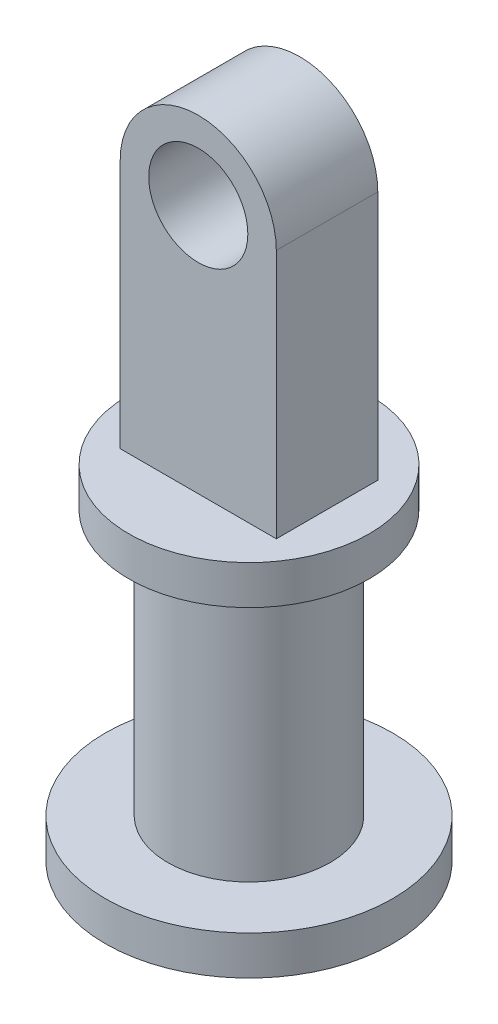
ISO-10303-21;
HEADER;
FILE_DESCRIPTION(('STEP AP214'),'2;1');
FILE_NAME('part.step','',(''),(''),'','','');
FILE_SCHEMA(('AUTOMOTIVE_DESIGN { 1 0 10303 214 1 1 1 1 }'));
ENDSEC;
DATA;
#1=APPLICATION_CONTEXT('core data for automotive mechanical design processes');
#2=APPLICATION_PROTOCOL_DEFINITION('international standard','automotive_design',2000,#1);
#3=PRODUCT_CONTEXT('',#1,'mechanical');
#4=PRODUCT('Part','Part','',(#3));
#5=PRODUCT_RELATED_PRODUCT_CATEGORY('part','',(#4));
#6=PRODUCT_DEFINITION_FORMATION('','',#4);
#7=PRODUCT_DEFINITION_CONTEXT('part definition',#1,'design');
#8=PRODUCT_DEFINITION('design','',#6,#7);
#9=PRODUCT_DEFINITION_SHAPE('','',#8);
#10=(LENGTH_UNIT() NAMED_UNIT(*) SI_UNIT(.MILLI.,.METRE.));
#11=(NAMED_UNIT(*) PLANE_ANGLE_UNIT() SI_UNIT($,.RADIAN.));
#12=(NAMED_UNIT(*) SI_UNIT($,.STERADIAN.) SOLID_ANGLE_UNIT());
#13=UNCERTAINTY_MEASURE_WITH_UNIT(LENGTH_MEASURE(1.E-05),#10,'distance_accuracy_value','');
#14=(GEOMETRIC_REPRESENTATION_CONTEXT(3) GLOBAL_UNCERTAINTY_ASSIGNED_CONTEXT((#13)) GLOBAL_UNIT_ASSIGNED_CONTEXT((#10,
#11,#12)) REPRESENTATION_CONTEXT('',''));
#15=CARTESIAN_POINT('',(0.,0.,0.));
#16=DIRECTION('',(0.,0.,1.));
#17=DIRECTION('',(1.,0.,0.));
#18=AXIS2_PLACEMENT_3D('',#15,#16,#17);
#19=CARTESIAN_POINT('',(0.,0.,3.25));
#20=DIRECTION('',(0.,0.,1.));
#21=DIRECTION('',(1.,0.,0.));
#22=AXIS2_PLACEMENT_3D('',#19,#20,#21);
#23=PLANE('',#22);
#24=CARTESIAN_POINT('',(0.,0.,3.25));
#25=DIRECTION('',(0.,0.,1.));
#26=DIRECTION('',(1.,0.,0.));
#27=AXIS2_PLACEMENT_3D('',#24,#25,#26);
#28=CIRCLE('',#27,2.5);
#29=CARTESIAN_POINT('',(2.5,0.,3.25));
#30=VERTEX_POINT('',#29);
#31=CARTESIAN_POINT('',(-2.5,0.,3.25));
#32=VERTEX_POINT('',#31);
#33=EDGE_CURVE('E79',#30,#32,#28,.T.);
#34=ORIENTED_EDGE('',*,*,#33,.T.);
#35=DIRECTION('',(0.,-1.,0.));
#36=VECTOR('',#35,1.);
#37=CARTESIAN_POINT('',(-2.5,-8.,3.25));
#38=LINE('',#37,#36);
#39=CARTESIAN_POINT('',(-2.5,-8.,3.25));
#40=VERTEX_POINT('',#39);
#41=EDGE_CURVE('E110',#32,#40,#38,.T.);
#42=ORIENTED_EDGE('',*,*,#41,.T.);
#43=DIRECTION('',(1.,0.,0.));
#44=VECTOR('',#43,1.);
#45=CARTESIAN_POINT('',(2.5,-8.,3.25));
#46=LINE('',#45,#44);
#47=CARTESIAN_POINT('',(2.5,-8.,3.25));
#48=VERTEX_POINT('',#47);
#49=EDGE_CURVE('E104',#40,#48,#46,.T.);
#50=ORIENTED_EDGE('',*,*,#49,.T.);
#51=DIRECTION('',(0.,1.,0.));
#52=VECTOR('',#51,1.);
#53=CARTESIAN_POINT('',(2.5,0.,3.25));
#54=LINE('',#53,#52);
#55=EDGE_CURVE('E51',#48,#30,#54,.T.);
#56=ORIENTED_EDGE('',*,*,#55,.T.);
#57=EDGE_LOOP('',(#34,#42,#50,#56));
#58=FACE_BOUND('',#57,.T.);
#59=CARTESIAN_POINT('',(0.,0.,3.25));
#60=DIRECTION('',(0.,0.,1.));
#61=DIRECTION('',(1.,0.,0.));
#62=AXIS2_PLACEMENT_3D('',#59,#60,#61);
#63=CIRCLE('',#62,1.5875);
#64=CARTESIAN_POINT('',(1.5875,0.,3.25));
#65=VERTEX_POINT('',#64);
#66=EDGE_CURVE('E90',#65,#65,#63,.T.);
#67=ORIENTED_EDGE('',*,*,#66,.F.);
#68=EDGE_LOOP('',(#67));
#69=FACE_BOUND('',#68,.T.);
#70=ADVANCED_FACE('F34',(#58,#69),#23,.T.);
#71=CARTESIAN_POINT('',(0.,0.,0.));
#72=DIRECTION('',(0.,0.,1.));
#73=DIRECTION('',(1.,0.,0.));
#74=AXIS2_PLACEMENT_3D('',#71,#72,#73);
#75=PLANE('',#74);
#76=CARTESIAN_POINT('',(0.,0.,0.));
#77=DIRECTION('',(0.,0.,1.));
#78=DIRECTION('',(1.,0.,0.));
#79=AXIS2_PLACEMENT_3D('',#76,#77,#78);
#80=CIRCLE('',#79,2.5);
#81=CARTESIAN_POINT('',(2.5,0.,0.));
#82=VERTEX_POINT('',#81);
#83=CARTESIAN_POINT('',(-2.5,0.,0.));
#84=VERTEX_POINT('',#83);
#85=EDGE_CURVE('E84',#82,#84,#80,.T.);
#86=ORIENTED_EDGE('',*,*,#85,.F.);
#87=DIRECTION('',(0.,1.,0.));
#88=VECTOR('',#87,1.);
#89=CARTESIAN_POINT('',(2.5,0.,0.));
#90=LINE('',#89,#88);
#91=CARTESIAN_POINT('',(2.5,-8.,0.));
#92=VERTEX_POINT('',#91);
#93=EDGE_CURVE('E71',#92,#82,#90,.T.);
#94=ORIENTED_EDGE('',*,*,#93,.F.);
#95=DIRECTION('',(1.,0.,0.));
#96=VECTOR('',#95,1.);
#97=CARTESIAN_POINT('',(2.5,-8.,0.));
#98=LINE('',#97,#96);
#99=CARTESIAN_POINT('',(-2.5,-8.,0.));
#100=VERTEX_POINT('',#99);
#101=EDGE_CURVE('E66',#100,#92,#98,.T.);
#102=ORIENTED_EDGE('',*,*,#101,.F.);
#103=DIRECTION('',(0.,-1.,0.));
#104=VECTOR('',#103,1.);
#105=CARTESIAN_POINT('',(-2.5,-8.,0.));
#106=LINE('',#105,#104);
#107=EDGE_CURVE('E89',#84,#100,#106,.T.);
#108=ORIENTED_EDGE('',*,*,#107,.F.);
#109=EDGE_LOOP('',(#86,#94,#102,#108));
#110=FACE_BOUND('',#109,.T.);
#111=CARTESIAN_POINT('',(0.,0.,0.));
#112=DIRECTION('',(0.,0.,1.));
#113=DIRECTION('',(1.,0.,0.));
#114=AXIS2_PLACEMENT_3D('',#111,#112,#113);
#115=CIRCLE('',#114,1.5875);
#116=CARTESIAN_POINT('',(1.5875,0.,0.));
#117=VERTEX_POINT('',#116);
#118=EDGE_CURVE('E94',#117,#117,#115,.T.);
#119=ORIENTED_EDGE('',*,*,#118,.T.);
#120=EDGE_LOOP('',(#119));
#121=FACE_BOUND('',#120,.T.);
#122=ADVANCED_FACE('F86',(#110,#121),#75,.F.);
#123=CARTESIAN_POINT('',(0.,0.,3.25));
#124=DIRECTION('',(0.,0.,-1.));
#125=DIRECTION('',(-1.,0.,0.));
#126=AXIS2_PLACEMENT_3D('',#123,#124,#125);
#127=CYLINDRICAL_SURFACE('',#126,2.5);
#128=ORIENTED_EDGE('',*,*,#85,.T.);
#129=DIRECTION('',(0.,0.,-1.));
#130=VECTOR('',#129,1.);
#131=CARTESIAN_POINT('',(-2.5,0.,3.25));
#132=LINE('',#131,#130);
#133=EDGE_CURVE('E11',#32,#84,#132,.T.);
#134=ORIENTED_EDGE('',*,*,#133,.F.);
#135=ORIENTED_EDGE('',*,*,#33,.F.);
#136=DIRECTION('',(0.,0.,-1.));
#137=VECTOR('',#136,1.);
#138=CARTESIAN_POINT('',(2.5,0.,3.25));
#139=LINE('',#138,#137);
#140=EDGE_CURVE('E74',#30,#82,#139,.T.);
#141=ORIENTED_EDGE('',*,*,#140,.T.);
#142=EDGE_LOOP('',(#128,#134,#135,#141));
#143=FACE_BOUND('',#142,.T.);
#144=ADVANCED_FACE('F36',(#143),#127,.T.);
#145=CARTESIAN_POINT('',(-2.5,-8.,3.25));
#146=DIRECTION('',(1.,0.,0.));
#147=DIRECTION('',(0.,1.,0.));
#148=AXIS2_PLACEMENT_3D('',#145,#146,#147);
#149=PLANE('',#148);
#150=ORIENTED_EDGE('',*,*,#107,.T.);
#151=DIRECTION('',(0.,0.,-1.));
#152=VECTOR('',#151,1.);
#153=CARTESIAN_POINT('',(-2.5,-8.,3.25));
#154=LINE('',#153,#152);
#155=EDGE_CURVE('E43',#40,#100,#154,.T.);
#156=ORIENTED_EDGE('',*,*,#155,.F.);
#157=ORIENTED_EDGE('',*,*,#41,.F.);
#158=ORIENTED_EDGE('',*,*,#133,.T.);
#159=EDGE_LOOP('',(#150,#156,#157,#158));
#160=FACE_BOUND('',#159,.T.);
#161=ADVANCED_FACE('F109',(#160),#149,.F.);
#162=CARTESIAN_POINT('',(2.5,0.,3.25));
#163=DIRECTION('',(-1.,0.,0.));
#164=DIRECTION('',(0.,-1.,0.));
#165=AXIS2_PLACEMENT_3D('',#162,#163,#164);
#166=PLANE('',#165);
#167=ORIENTED_EDGE('',*,*,#93,.T.);
#168=ORIENTED_EDGE('',*,*,#140,.F.);
#169=ORIENTED_EDGE('',*,*,#55,.F.);
#170=DIRECTION('',(0.,0.,-1.));
#171=VECTOR('',#170,1.);
#172=CARTESIAN_POINT('',(2.5,-8.,3.25));
#173=LINE('',#172,#171);
#174=EDGE_CURVE('E76',#48,#92,#173,.T.);
#175=ORIENTED_EDGE('',*,*,#174,.T.);
#176=EDGE_LOOP('',(#167,#168,#169,#175));
#177=FACE_BOUND('',#176,.T.);
#178=ADVANCED_FACE('F73',(#177),#166,.F.);
#179=CARTESIAN_POINT('',(0.,0.,3.25));
#180=DIRECTION('',(0.,0.,-1.));
#181=DIRECTION('',(-1.,0.,0.));
#182=AXIS2_PLACEMENT_3D('',#179,#180,#181);
#183=CYLINDRICAL_SURFACE('',#182,1.5875);
#184=ORIENTED_EDGE('',*,*,#66,.T.);
#185=EDGE_LOOP('',(#184));
#186=FACE_BOUND('',#185,.T.);
#187=ORIENTED_EDGE('',*,*,#118,.F.);
#188=EDGE_LOOP('',(#187));
#189=FACE_BOUND('',#188,.T.);
#190=ADVANCED_FACE('F148',(#186,#189),#183,.F.);
#191=CARTESIAN_POINT('',(0.,-8.,1.625));
#192=DIRECTION('',(0.,1.,0.));
#193=DIRECTION('',(-1.,0.,0.));
#194=AXIS2_PLACEMENT_3D('',#191,#192,#193);
#195=PLANE('',#194);
#196=CARTESIAN_POINT('',(0.,-8.,1.625));
#197=DIRECTION('',(0.,-1.,0.));
#198=DIRECTION('',(1.,0.,0.));
#199=AXIS2_PLACEMENT_3D('',#196,#197,#198);
#200=CIRCLE('',#199,3.85);
#201=CARTESIAN_POINT('',(3.85,-8.,1.625));
#202=VERTEX_POINT('',#201);
#203=EDGE_CURVE('E139',#202,#202,#200,.T.);
#204=ORIENTED_EDGE('',*,*,#203,.F.);
#205=EDGE_LOOP('',(#204));
#206=FACE_BOUND('',#205,.T.);
#207=ORIENTED_EDGE('',*,*,#155,.T.);
#208=ORIENTED_EDGE('',*,*,#101,.T.);
#209=ORIENTED_EDGE('',*,*,#174,.F.);
#210=ORIENTED_EDGE('',*,*,#49,.F.);
#211=EDGE_LOOP('',(#207,#208,#209,#210));
#212=FACE_BOUND('',#211,.T.);
#213=ADVANCED_FACE('F103',(#206,#212),#195,.T.);
#214=CARTESIAN_POINT('',(0.,-9.25,1.625));
#215=DIRECTION('',(0.,-1.,0.));
#216=DIRECTION('',(1.,0.,0.));
#217=AXIS2_PLACEMENT_3D('',#214,#215,#216);
#218=PLANE('',#217);
#219=CARTESIAN_POINT('',(0.,-9.25,1.625));
#220=DIRECTION('',(0.,-1.,0.));
#221=DIRECTION('',(1.,0.,0.));
#222=AXIS2_PLACEMENT_3D('',#219,#220,#221);
#223=CIRCLE('',#222,1.35);
#224=CARTESIAN_POINT('',(1.35,-9.25,1.625));
#225=VERTEX_POINT('',#224);
#226=EDGE_CURVE('E117',#225,#225,#223,.T.);
#227=ORIENTED_EDGE('',*,*,#226,.T.);
#228=EDGE_LOOP('',(#227));
#229=FACE_BOUND('',#228,.T.);
#230=ADVANCED_FACE('F147',(#229),#218,.T.);
#231=CARTESIAN_POINT('',(0.,-19.5,1.625));
#232=DIRECTION('',(0.,-1.,0.));
#233=DIRECTION('',(1.,0.,0.));
#234=AXIS2_PLACEMENT_3D('',#231,#232,#233);
#235=CYLINDRICAL_SURFACE('',#234,1.35);
#236=CARTESIAN_POINT('',(0.,-18.9948318531321,1.625));
#237=DIRECTION('',(0.,-1.,0.));
#238=DIRECTION('',(1.,0.,0.));
#239=AXIS2_PLACEMENT_3D('',#236,#237,#238);
#240=CIRCLE('',#239,1.35);
#241=CARTESIAN_POINT('',(1.35,-18.9948318531321,1.625));
#242=VERTEX_POINT('',#241);
#243=EDGE_CURVE('E121',#242,#242,#240,.T.);
#244=ORIENTED_EDGE('',*,*,#243,.T.);
#245=EDGE_LOOP('',(#244));
#246=FACE_BOUND('',#245,.T.);
#247=ORIENTED_EDGE('',*,*,#226,.F.);
#248=EDGE_LOOP('',(#247));
#249=FACE_BOUND('',#248,.T.);
#250=ADVANCED_FACE('F154',(#246,#249),#235,.F.);
#251=CARTESIAN_POINT('',(0.,-18.9948318531321,1.625));
#252=DIRECTION('',(0.,-1.,0.));
#253=DIRECTION('',(1.,0.,0.));
#254=AXIS2_PLACEMENT_3D('',#251,#252,#253);
#255=PLANE('',#254);
#256=CARTESIAN_POINT('',(0.,-18.9948318531321,1.625));
#257=DIRECTION('',(0.,-1.,0.));
#258=DIRECTION('',(1.,0.,0.));
#259=AXIS2_PLACEMENT_3D('',#256,#257,#258);
#260=CIRCLE('',#259,4.6);
#261=CARTESIAN_POINT('',(4.6,-18.9948318531321,1.625));
#262=VERTEX_POINT('',#261);
#263=EDGE_CURVE('E124',#262,#262,#260,.T.);
#264=ORIENTED_EDGE('',*,*,#263,.T.);
#265=EDGE_LOOP('',(#264));
#266=FACE_BOUND('',#265,.T.);
#267=ORIENTED_EDGE('',*,*,#243,.F.);
#268=EDGE_LOOP('',(#267));
#269=FACE_BOUND('',#268,.T.);
#270=ADVANCED_FACE('F212',(#266,#269),#255,.T.);
#271=CARTESIAN_POINT('',(0.,-19.5,1.625));
#272=DIRECTION('',(0.,-1.,0.));
#273=DIRECTION('',(1.,0.,0.));
#274=AXIS2_PLACEMENT_3D('',#271,#272,#273);
#275=CYLINDRICAL_SURFACE('',#274,4.6);
#276=CARTESIAN_POINT('',(0.,-17.7448318531321,1.625));
#277=DIRECTION('',(0.,-1.,0.));
#278=DIRECTION('',(1.,0.,0.));
#279=AXIS2_PLACEMENT_3D('',#276,#277,#278);
#280=CIRCLE('',#279,4.6);
#281=CARTESIAN_POINT('',(4.6,-17.7448318531321,1.625));
#282=VERTEX_POINT('',#281);
#283=EDGE_CURVE('E127',#282,#282,#280,.T.);
#284=ORIENTED_EDGE('',*,*,#283,.T.);
#285=EDGE_LOOP('',(#284));
#286=FACE_BOUND('',#285,.T.);
#287=ORIENTED_EDGE('',*,*,#263,.F.);
#288=EDGE_LOOP('',(#287));
#289=FACE_BOUND('',#288,.T.);
#290=ADVANCED_FACE('F222',(#286,#289),#275,.T.);
#291=CARTESIAN_POINT('',(0.,-17.7448318531321,1.625));
#292=DIRECTION('',(0.,-1.,0.));
#293=DIRECTION('',(1.,0.,0.));
#294=AXIS2_PLACEMENT_3D('',#291,#292,#293);
#295=PLANE('',#294);
#296=ORIENTED_EDGE('',*,*,#283,.F.);
#297=EDGE_LOOP('',(#296));
#298=FACE_BOUND('',#297,.T.);
#299=CARTESIAN_POINT('',(0.,-17.7448318531321,1.625));
#300=DIRECTION('',(0.,-1.,0.));
#301=DIRECTION('',(1.,0.,0.));
#302=AXIS2_PLACEMENT_3D('',#299,#300,#301);
#303=CIRCLE('',#302,2.6);
#304=CARTESIAN_POINT('',(2.6,-17.7448318531321,1.625));
#305=VERTEX_POINT('',#304);
#306=EDGE_CURVE('E130',#305,#305,#303,.T.);
#307=ORIENTED_EDGE('',*,*,#306,.T.);
#308=EDGE_LOOP('',(#307));
#309=FACE_BOUND('',#308,.T.);
#310=ADVANCED_FACE('F232',(#298,#309),#295,.F.);
#311=CARTESIAN_POINT('',(0.,-19.5,1.625));
#312=DIRECTION('',(0.,-1.,0.));
#313=DIRECTION('',(1.,0.,0.));
#314=AXIS2_PLACEMENT_3D('',#311,#312,#313);
#315=CYLINDRICAL_SURFACE('',#314,2.6);
#316=ORIENTED_EDGE('',*,*,#306,.F.);
#317=EDGE_LOOP('',(#316));
#318=FACE_BOUND('',#317,.T.);
#319=CARTESIAN_POINT('',(0.,-9.25,1.625));
#320=DIRECTION('',(0.,-1.,0.));
#321=DIRECTION('',(1.,0.,0.));
#322=AXIS2_PLACEMENT_3D('',#319,#320,#321);
#323=CIRCLE('',#322,2.6);
#324=CARTESIAN_POINT('',(2.6,-9.25,1.625));
#325=VERTEX_POINT('',#324);
#326=EDGE_CURVE('E133',#325,#325,#323,.T.);
#327=ORIENTED_EDGE('',*,*,#326,.T.);
#328=EDGE_LOOP('',(#327));
#329=FACE_BOUND('',#328,.T.);
#330=ADVANCED_FACE('F242',(#318,#329),#315,.T.);
#331=CARTESIAN_POINT('',(0.,-9.25,1.625));
#332=DIRECTION('',(0.,-1.,0.));
#333=DIRECTION('',(1.,0.,0.));
#334=AXIS2_PLACEMENT_3D('',#331,#332,#333);
#335=PLANE('',#334);
#336=CARTESIAN_POINT('',(0.,-9.25,1.625));
#337=DIRECTION('',(0.,-1.,0.));
#338=DIRECTION('',(1.,0.,0.));
#339=AXIS2_PLACEMENT_3D('',#336,#337,#338);
#340=CIRCLE('',#339,3.85);
#341=CARTESIAN_POINT('',(3.85,-9.25,1.625));
#342=VERTEX_POINT('',#341);
#343=EDGE_CURVE('E136',#342,#342,#340,.T.);
#344=ORIENTED_EDGE('',*,*,#343,.T.);
#345=EDGE_LOOP('',(#344));
#346=FACE_BOUND('',#345,.T.);
#347=ORIENTED_EDGE('',*,*,#326,.F.);
#348=EDGE_LOOP('',(#347));
#349=FACE_BOUND('',#348,.T.);
#350=ADVANCED_FACE('F252',(#346,#349),#335,.T.);
#351=CARTESIAN_POINT('',(0.,-19.5,1.625));
#352=DIRECTION('',(0.,-1.,0.));
#353=DIRECTION('',(1.,0.,0.));
#354=AXIS2_PLACEMENT_3D('',#351,#352,#353);
#355=CYLINDRICAL_SURFACE('',#354,3.85);
#356=ORIENTED_EDGE('',*,*,#203,.T.);
#357=EDGE_LOOP('',(#356));
#358=FACE_BOUND('',#357,.T.);
#359=ORIENTED_EDGE('',*,*,#343,.F.);
#360=EDGE_LOOP('',(#359));
#361=FACE_BOUND('',#360,.T.);
#362=ADVANCED_FACE('F143',(#358,#361),#355,.T.);
#363=CLOSED_SHELL('',(#70,#122,#144,#161,#178,#190,#213,#230,#250,#270,#290,#310,#330,#350,#362));
#364=MANIFOLD_SOLID_BREP('B2',#363);
#365=ADVANCED_BREP_SHAPE_REPRESENTATION('',(#18,#364),#14);
#366=SHAPE_DEFINITION_REPRESENTATION(#9,#365);
ENDSEC;
END-ISO-10303-21;
